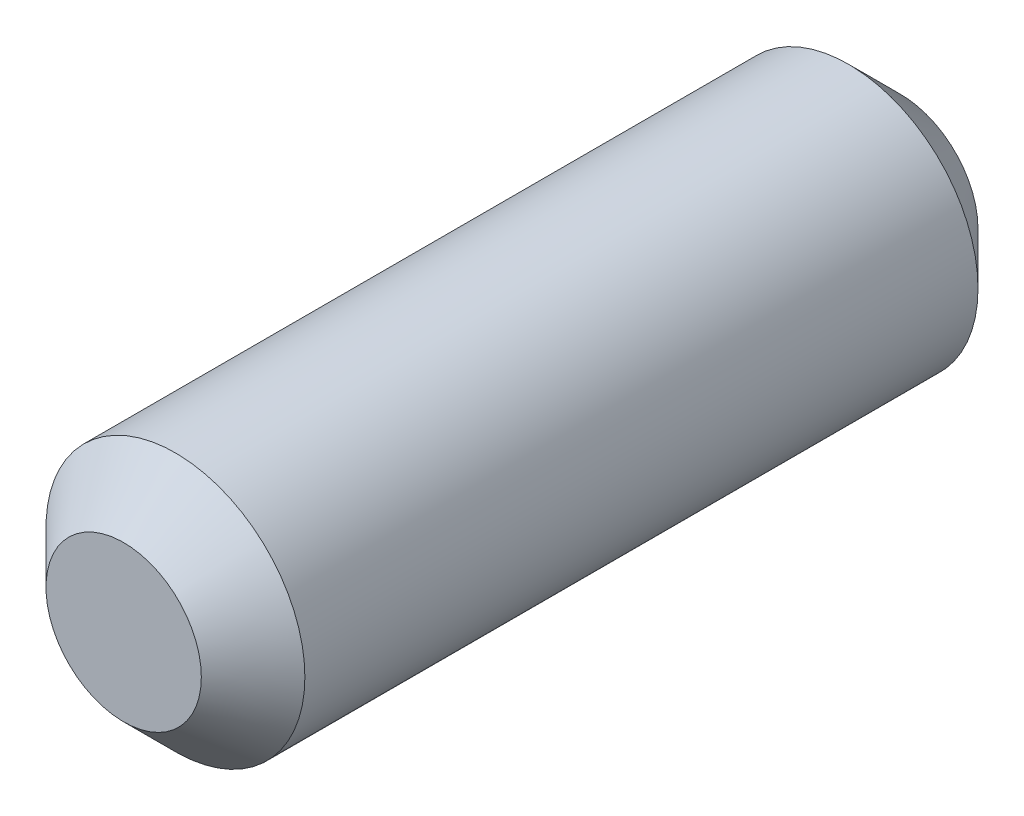
ISO-10303-21;
HEADER;
FILE_DESCRIPTION(('STEP AP214'),'2;1');
FILE_NAME('part.step','',(''),(''),'','','');
FILE_SCHEMA(('AUTOMOTIVE_DESIGN { 1 0 10303 214 1 1 1 1 }'));
ENDSEC;
DATA;
#1=APPLICATION_CONTEXT('core data for automotive mechanical design processes');
#2=APPLICATION_PROTOCOL_DEFINITION('international standard','automotive_design',2000,#1);
#3=PRODUCT_CONTEXT('',#1,'mechanical');
#4=PRODUCT('Part','Part','',(#3));
#5=PRODUCT_RELATED_PRODUCT_CATEGORY('part','',(#4));
#6=PRODUCT_DEFINITION_FORMATION('','',#4);
#7=PRODUCT_DEFINITION_CONTEXT('part definition',#1,'design');
#8=PRODUCT_DEFINITION('design','',#6,#7);
#9=PRODUCT_DEFINITION_SHAPE('','',#8);
#10=(LENGTH_UNIT() NAMED_UNIT(*) SI_UNIT(.MILLI.,.METRE.));
#11=(NAMED_UNIT(*) PLANE_ANGLE_UNIT() SI_UNIT($,.RADIAN.));
#12=(NAMED_UNIT(*) SI_UNIT($,.STERADIAN.) SOLID_ANGLE_UNIT());
#13=UNCERTAINTY_MEASURE_WITH_UNIT(LENGTH_MEASURE(1.E-05),#10,'distance_accuracy_value','');
#14=(GEOMETRIC_REPRESENTATION_CONTEXT(3) GLOBAL_UNCERTAINTY_ASSIGNED_CONTEXT((#13)) GLOBAL_UNIT_ASSIGNED_CONTEXT((#10,
#11,#12)) REPRESENTATION_CONTEXT('',''));
#15=CARTESIAN_POINT('',(0.,0.,0.));
#16=DIRECTION('',(0.,0.,1.));
#17=DIRECTION('',(1.,0.,0.));
#18=AXIS2_PLACEMENT_3D('',#15,#16,#17);
#19=CARTESIAN_POINT('',(0.,0.,38.1));
#20=DIRECTION('',(0.,0.,-1.));
#21=DIRECTION('',(-1.,0.,0.));
#22=AXIS2_PLACEMENT_3D('',#19,#20,#21);
#23=CYLINDRICAL_SURFACE('',#22,6.35);
#24=CARTESIAN_POINT('',(0.,0.,2.54000000000003));
#25=DIRECTION('',(0.,0.,1.));
#26=DIRECTION('',(1.,0.,0.));
#27=AXIS2_PLACEMENT_3D('',#24,#25,#26);
#28=CIRCLE('',#27,6.35);
#29=CARTESIAN_POINT('',(6.35,0.,2.54000000000003));
#30=VERTEX_POINT('',#29);
#31=EDGE_CURVE('E37',#30,#30,#28,.T.);
#32=ORIENTED_EDGE('',*,*,#31,.T.);
#33=EDGE_LOOP('',(#32));
#34=FACE_BOUND('',#33,.T.);
#35=CARTESIAN_POINT('',(0.,0.,35.56));
#36=DIRECTION('',(0.,0.,1.));
#37=DIRECTION('',(1.,0.,0.));
#38=AXIS2_PLACEMENT_3D('',#35,#36,#37);
#39=CIRCLE('',#38,6.35);
#40=CARTESIAN_POINT('',(6.35,0.,35.56));
#41=VERTEX_POINT('',#40);
#42=EDGE_CURVE('E41',#41,#41,#39,.F.);
#43=ORIENTED_EDGE('',*,*,#42,.T.);
#44=EDGE_LOOP('',(#43));
#45=FACE_BOUND('',#44,.T.);
#46=ADVANCED_FACE('F30',(#34,#45),#23,.T.);
#47=CARTESIAN_POINT('',(0.,0.,38.1));
#48=DIRECTION('',(0.,0.,1.));
#49=DIRECTION('',(1.,0.,0.));
#50=AXIS2_PLACEMENT_3D('',#47,#48,#49);
#51=PLANE('',#50);
#52=CARTESIAN_POINT('',(0.,0.,38.1));
#53=DIRECTION('',(0.,0.,1.));
#54=DIRECTION('',(1.,0.,0.));
#55=AXIS2_PLACEMENT_3D('',#52,#53,#54);
#56=CIRCLE('',#55,3.81000000000004);
#57=CARTESIAN_POINT('',(3.81000000000004,0.,38.1));
#58=VERTEX_POINT('',#57);
#59=EDGE_CURVE('E45',#58,#58,#56,.T.);
#60=ORIENTED_EDGE('',*,*,#59,.T.);
#61=EDGE_LOOP('',(#60));
#62=FACE_BOUND('',#61,.T.);
#63=ADVANCED_FACE('F51',(#62),#51,.T.);
#64=CARTESIAN_POINT('',(0.,0.,0.));
#65=DIRECTION('',(0.,0.,1.));
#66=DIRECTION('',(1.,0.,0.));
#67=AXIS2_PLACEMENT_3D('',#64,#65,#66);
#68=PLANE('',#67);
#69=CARTESIAN_POINT('',(0.,0.,0.));
#70=DIRECTION('',(0.,0.,1.));
#71=DIRECTION('',(1.,0.,0.));
#72=AXIS2_PLACEMENT_3D('',#69,#70,#71);
#73=CIRCLE('',#72,3.80999999999995);
#74=CARTESIAN_POINT('',(3.80999999999995,0.,0.));
#75=VERTEX_POINT('',#74);
#76=EDGE_CURVE('E10',#75,#75,#73,.F.);
#77=ORIENTED_EDGE('',*,*,#76,.T.);
#78=EDGE_LOOP('',(#77));
#79=FACE_BOUND('',#78,.T.);
#80=ADVANCED_FACE('F55',(#79),#68,.F.);
#81=CARTESIAN_POINT('',(0.,0.,38.1));
#82=DIRECTION('',(0.,0.,-1.));
#83=DIRECTION('',(-1.,0.,0.));
#84=AXIS2_PLACEMENT_3D('',#81,#82,#83);
#85=CONICAL_SURFACE('',#84,3.81000000000004,0.785398163397448);
#86=ORIENTED_EDGE('',*,*,#42,.F.);
#87=EDGE_LOOP('',(#86));
#88=FACE_BOUND('',#87,.T.);
#89=ORIENTED_EDGE('',*,*,#59,.F.);
#90=EDGE_LOOP('',(#89));
#91=FACE_BOUND('',#90,.T.);
#92=ADVANCED_FACE('F53',(#88,#91),#85,.T.);
#93=CARTESIAN_POINT('',(0.,0.,2.54000000000003));
#94=DIRECTION('',(0.,0.,1.));
#95=DIRECTION('',(1.,0.,0.));
#96=AXIS2_PLACEMENT_3D('',#93,#94,#95);
#97=CONICAL_SURFACE('',#96,6.35,0.785398163397451);
#98=ORIENTED_EDGE('',*,*,#76,.F.);
#99=EDGE_LOOP('',(#98));
#100=FACE_BOUND('',#99,.T.);
#101=ORIENTED_EDGE('',*,*,#31,.F.);
#102=EDGE_LOOP('',(#101));
#103=FACE_BOUND('',#102,.T.);
#104=ADVANCED_FACE('F32',(#100,#103),#97,.T.);
#105=CLOSED_SHELL('',(#46,#63,#80,#92,#104));
#106=MANIFOLD_SOLID_BREP('B2',#105);
#107=ADVANCED_BREP_SHAPE_REPRESENTATION('',(#18,#106),#14);
#108=SHAPE_DEFINITION_REPRESENTATION(#9,#107);
ENDSEC;
END-ISO-10303-21;
